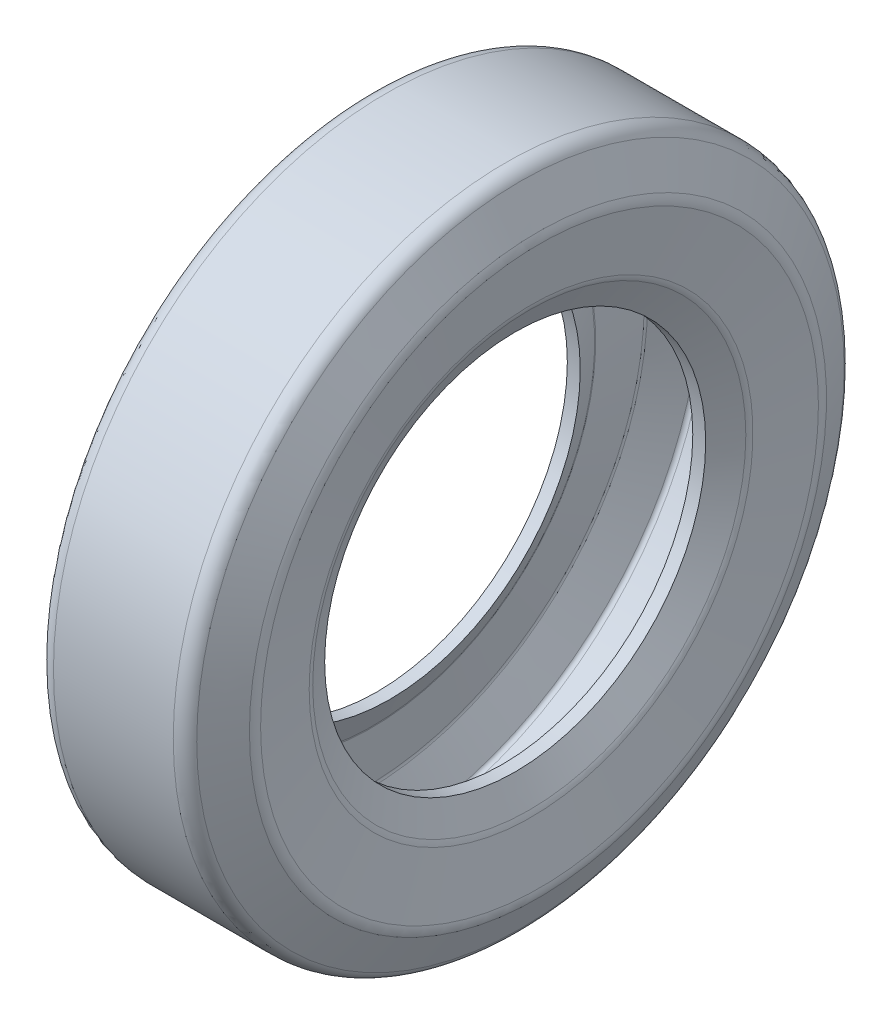
ISO-10303-21;
HEADER;
FILE_DESCRIPTION(('STEP AP214'),'2;1');
FILE_NAME('part.step','',(''),(''),'','','');
FILE_SCHEMA(('AUTOMOTIVE_DESIGN { 1 0 10303 214 1 1 1 1 }'));
ENDSEC;
DATA;
#1=APPLICATION_CONTEXT('core data for automotive mechanical design processes');
#2=APPLICATION_PROTOCOL_DEFINITION('international standard','automotive_design',2000,#1);
#3=PRODUCT_CONTEXT('',#1,'mechanical');
#4=PRODUCT('Part','Part','',(#3));
#5=PRODUCT_RELATED_PRODUCT_CATEGORY('part','',(#4));
#6=PRODUCT_DEFINITION_FORMATION('','',#4);
#7=PRODUCT_DEFINITION_CONTEXT('part definition',#1,'design');
#8=PRODUCT_DEFINITION('design','',#6,#7);
#9=PRODUCT_DEFINITION_SHAPE('','',#8);
#10=(LENGTH_UNIT() NAMED_UNIT(*) SI_UNIT(.MILLI.,.METRE.));
#11=(NAMED_UNIT(*) PLANE_ANGLE_UNIT() SI_UNIT($,.RADIAN.));
#12=(NAMED_UNIT(*) SI_UNIT($,.STERADIAN.) SOLID_ANGLE_UNIT());
#13=UNCERTAINTY_MEASURE_WITH_UNIT(LENGTH_MEASURE(1.E-05),#10,'distance_accuracy_value','');
#14=(GEOMETRIC_REPRESENTATION_CONTEXT(3) GLOBAL_UNCERTAINTY_ASSIGNED_CONTEXT((#13)) GLOBAL_UNIT_ASSIGNED_CONTEXT((#10,
#11,#12)) REPRESENTATION_CONTEXT('',''));
#15=CARTESIAN_POINT('',(0.,0.,0.));
#16=DIRECTION('',(0.,0.,1.));
#17=DIRECTION('',(1.,0.,0.));
#18=AXIS2_PLACEMENT_3D('',#15,#16,#17);
#19=CARTESIAN_POINT('',(-234.496124031008,0.,0.));
#20=DIRECTION('',(-1.,0.,0.));
#21=DIRECTION('',(0.,0.,1.));
#22=AXIS2_PLACEMENT_3D('',#19,#20,#21);
#23=CYLINDRICAL_SURFACE('',#22,117.412834164463);
#24=CARTESIAN_POINT('',(-42.6353370457909,0.,0.));
#25=DIRECTION('',(-1.,0.,0.));
#26=DIRECTION('',(0.,0.,1.));
#27=AXIS2_PLACEMENT_3D('',#24,#25,#26);
#28=CIRCLE('',#27,117.412834164463);
#29=CARTESIAN_POINT('',(-42.6353370457909,0.,117.412834164463));
#30=VERTEX_POINT('',#29);
#31=EDGE_CURVE('E44',#30,#30,#28,.T.);
#32=ORIENTED_EDGE('',*,*,#31,.T.);
#33=EDGE_LOOP('',(#32));
#34=FACE_BOUND('',#33,.T.);
#35=CARTESIAN_POINT('',(-34.6749867932723,0.,0.));
#36=DIRECTION('',(-1.,0.,0.));
#37=DIRECTION('',(0.,0.,1.));
#38=AXIS2_PLACEMENT_3D('',#35,#36,#37);
#39=CIRCLE('',#38,117.412834164463);
#40=CARTESIAN_POINT('',(-34.6749867932723,0.,117.412834164463));
#41=VERTEX_POINT('',#40);
#42=EDGE_CURVE('E84',#41,#41,#39,.T.);
#43=ORIENTED_EDGE('',*,*,#42,.F.);
#44=EDGE_LOOP('',(#43));
#45=FACE_BOUND('',#44,.T.);
#46=ADVANCED_FACE('F33',(#34,#45),#23,.F.);
#47=CARTESIAN_POINT('',(42.5253680064834,0.,0.));
#48=DIRECTION('',(-1.,0.,0.));
#49=DIRECTION('',(0.,0.,1.));
#50=AXIS2_PLACEMENT_3D('',#47,#48,#49);
#51=TOROIDAL_SURFACE('',#50,138.211060890307,9.99999999999999);
#52=CARTESIAN_POINT('',(52.4171984301819,0.,0.));
#53=DIRECTION('',(-1.,0.,0.));
#54=DIRECTION('',(0.,0.,1.));
#55=AXIS2_PLACEMENT_3D('',#52,#53,#54);
#56=CIRCLE('',#55,136.744196592291);
#57=CARTESIAN_POINT('',(52.4171984301819,0.,136.744196592291));
#58=VERTEX_POINT('',#57);
#59=EDGE_CURVE('E80',#58,#58,#56,.T.);
#60=ORIENTED_EDGE('',*,*,#59,.F.);
#61=EDGE_LOOP('',(#60));
#62=FACE_BOUND('',#61,.T.);
#63=CARTESIAN_POINT('',(51.3189509242517,0.,0.));
#64=DIRECTION('',(-1.,0.,0.));
#65=DIRECTION('',(0.,0.,1.));
#66=AXIS2_PLACEMENT_3D('',#63,#64,#65);
#67=CIRCLE('',#66,133.4494540745);
#68=CARTESIAN_POINT('',(51.3189509242517,0.,133.4494540745));
#69=VERTEX_POINT('',#68);
#70=EDGE_CURVE('E10',#69,#69,#67,.T.);
#71=ORIENTED_EDGE('',*,*,#70,.T.);
#72=EDGE_LOOP('',(#71));
#73=FACE_BOUND('',#72,.T.);
#74=ADVANCED_FACE('F35',(#62,#73),#51,.T.);
#75=CARTESIAN_POINT('',(42.6353370457909,0.,0.));
#76=DIRECTION('',(1.,0.,0.));
#77=DIRECTION('',(0.,0.,-1.));
#78=AXIS2_PLACEMENT_3D('',#75,#76,#77);
#79=CONICAL_SURFACE('',#78,117.412834164463,1.07451284719882);
#80=ORIENTED_EDGE('',*,*,#70,.F.);
#81=EDGE_LOOP('',(#80));
#82=FACE_BOUND('',#81,.T.);
#83=CARTESIAN_POINT('',(42.6353370457909,0.,0.));
#84=DIRECTION('',(-1.,0.,0.));
#85=DIRECTION('',(0.,0.,1.));
#86=AXIS2_PLACEMENT_3D('',#83,#84,#85);
#87=CIRCLE('',#86,117.412834164463);
#88=CARTESIAN_POINT('',(42.6353370457909,0.,117.412834164463));
#89=VERTEX_POINT('',#88);
#90=EDGE_CURVE('E40',#89,#89,#87,.T.);
#91=ORIENTED_EDGE('',*,*,#90,.T.);
#92=EDGE_LOOP('',(#91));
#93=FACE_BOUND('',#92,.T.);
#94=ADVANCED_FACE('F148',(#82,#93),#79,.F.);
#95=CARTESIAN_POINT('',(34.6749867932723,0.,0.));
#96=DIRECTION('',(1.,0.,0.));
#97=DIRECTION('',(0.,0.,-1.));
#98=AXIS2_PLACEMENT_3D('',#95,#96,#97);
#99=CIRCLE('',#98,117.412834164463);
#100=CARTESIAN_POINT('',(34.6749867932723,0.,-117.412834164463));
#101=VERTEX_POINT('',#100);
#102=EDGE_CURVE('E87',#101,#101,#99,.F.);
#103=ORIENTED_EDGE('',*,*,#102,.T.);
#104=EDGE_LOOP('',(#103));
#105=FACE_BOUND('',#104,.T.);
#106=ORIENTED_EDGE('',*,*,#90,.F.);
#107=EDGE_LOOP('',(#106));
#108=FACE_BOUND('',#107,.T.);
#109=ADVANCED_FACE('F144',(#105,#108),#23,.F.);
#110=CARTESIAN_POINT('',(-51.3189509242517,0.,0.));
#111=DIRECTION('',(-1.,0.,0.));
#112=DIRECTION('',(0.,0.,1.));
#113=AXIS2_PLACEMENT_3D('',#110,#111,#112);
#114=CONICAL_SURFACE('',#113,133.4494540745,1.07451284719882);
#115=ORIENTED_EDGE('',*,*,#31,.F.);
#116=EDGE_LOOP('',(#115));
#117=FACE_BOUND('',#116,.T.);
#118=CARTESIAN_POINT('',(-51.3189509242517,0.,0.));
#119=DIRECTION('',(-1.,0.,0.));
#120=DIRECTION('',(0.,0.,1.));
#121=AXIS2_PLACEMENT_3D('',#118,#119,#120);
#122=CIRCLE('',#121,133.4494540745);
#123=CARTESIAN_POINT('',(-51.3189509242517,0.,133.4494540745));
#124=VERTEX_POINT('',#123);
#125=EDGE_CURVE('E48',#124,#124,#122,.T.);
#126=ORIENTED_EDGE('',*,*,#125,.T.);
#127=EDGE_LOOP('',(#126));
#128=FACE_BOUND('',#127,.T.);
#129=ADVANCED_FACE('F153',(#117,#128),#114,.F.);
#130=CARTESIAN_POINT('',(-42.5253680064834,0.,0.));
#131=DIRECTION('',(-1.,0.,0.));
#132=DIRECTION('',(0.,0.,1.));
#133=AXIS2_PLACEMENT_3D('',#130,#131,#132);
#134=TOROIDAL_SURFACE('',#133,138.211060890307,9.99999999999999);
#135=ORIENTED_EDGE('',*,*,#125,.F.);
#136=EDGE_LOOP('',(#135));
#137=FACE_BOUND('',#136,.T.);
#138=CARTESIAN_POINT('',(-52.4171984301819,0.,0.));
#139=DIRECTION('',(-1.,0.,0.));
#140=DIRECTION('',(0.,0.,1.));
#141=AXIS2_PLACEMENT_3D('',#138,#139,#140);
#142=CIRCLE('',#141,136.744196592291);
#143=CARTESIAN_POINT('',(-52.4171984301819,0.,136.744196592291));
#144=VERTEX_POINT('',#143);
#145=EDGE_CURVE('E53',#144,#144,#142,.T.);
#146=ORIENTED_EDGE('',*,*,#145,.T.);
#147=EDGE_LOOP('',(#146));
#148=FACE_BOUND('',#147,.T.);
#149=ADVANCED_FACE('F159',(#137,#148),#134,.T.);
#150=CARTESIAN_POINT('',(-57.6276694071352,0.,0.));
#151=DIRECTION('',(-1.,0.,0.));
#152=DIRECTION('',(0.,0.,1.));
#153=AXIS2_PLACEMENT_3D('',#150,#151,#152);
#154=CONICAL_SURFACE('',#153,171.881117847612,1.42357869759769);
#155=ORIENTED_EDGE('',*,*,#145,.F.);
#156=EDGE_LOOP('',(#155));
#157=FACE_BOUND('',#156,.T.);
#158=CARTESIAN_POINT('',(-57.6276694071352,0.,0.));
#159=DIRECTION('',(-1.,0.,0.));
#160=DIRECTION('',(0.,0.,1.));
#161=AXIS2_PLACEMENT_3D('',#158,#159,#160);
#162=CIRCLE('',#161,171.881117847612);
#163=CARTESIAN_POINT('',(-57.6276694071352,0.,171.881117847612));
#164=VERTEX_POINT('',#163);
#165=EDGE_CURVE('E56',#164,#164,#162,.T.);
#166=ORIENTED_EDGE('',*,*,#165,.T.);
#167=EDGE_LOOP('',(#166));
#168=FACE_BOUND('',#167,.T.);
#169=ADVANCED_FACE('F357',(#157,#168),#154,.F.);
#170=CARTESIAN_POINT('',(-47.7358389834368,0.,0.));
#171=DIRECTION('',(-1.,0.,0.));
#172=DIRECTION('',(0.,0.,1.));
#173=AXIS2_PLACEMENT_3D('',#170,#171,#172);
#174=TOROIDAL_SURFACE('',#173,173.347982145627,9.99999999999999);
#175=ORIENTED_EDGE('',*,*,#165,.F.);
#176=EDGE_LOOP('',(#175));
#177=FACE_BOUND('',#176,.T.);
#178=CARTESIAN_POINT('',(-56.6801108934359,0.,0.));
#179=DIRECTION('',(-1.,0.,0.));
#180=DIRECTION('',(0.,0.,1.));
#181=AXIS2_PLACEMENT_3D('',#178,#179,#180);
#182=CIRCLE('',#181,177.820118100627);
#183=CARTESIAN_POINT('',(-56.6801108934359,0.,177.820118100627));
#184=VERTEX_POINT('',#183);
#185=EDGE_CURVE('E59',#184,#184,#182,.T.);
#186=ORIENTED_EDGE('',*,*,#185,.T.);
#187=EDGE_LOOP('',(#186));
#188=FACE_BOUND('',#187,.T.);
#189=ADVANCED_FACE('F347',(#177,#188),#174,.T.);
#190=CARTESIAN_POINT('',(-45.8541019662497,0.,0.));
#191=DIRECTION('',(1.,0.,0.));
#192=DIRECTION('',(0.,0.,-1.));
#193=AXIS2_PLACEMENT_3D('',#190,#191,#192);
#194=CONICAL_SURFACE('',#193,199.472135955,1.10714871779409);
#195=ORIENTED_EDGE('',*,*,#185,.F.);
#196=EDGE_LOOP('',(#195));
#197=FACE_BOUND('',#196,.T.);
#198=CARTESIAN_POINT('',(-45.8541019662497,0.,0.));
#199=DIRECTION('',(-1.,0.,0.));
#200=DIRECTION('',(0.,0.,1.));
#201=AXIS2_PLACEMENT_3D('',#198,#199,#200);
#202=CIRCLE('',#201,199.472135955);
#203=CARTESIAN_POINT('',(-45.8541019662497,0.,199.472135955));
#204=VERTEX_POINT('',#203);
#205=EDGE_CURVE('E62',#204,#204,#202,.T.);
#206=ORIENTED_EDGE('',*,*,#205,.T.);
#207=EDGE_LOOP('',(#206));
#208=FACE_BOUND('',#207,.T.);
#209=ADVANCED_FACE('F338',(#197,#208),#194,.T.);
#210=CARTESIAN_POINT('',(-36.9098300562505,0.,0.));
#211=DIRECTION('',(-1.,0.,0.));
#212=DIRECTION('',(0.,0.,1.));
#213=AXIS2_PLACEMENT_3D('',#210,#211,#212);
#214=TOROIDAL_SURFACE('',#213,195.,9.99999999999999);
#215=ORIENTED_EDGE('',*,*,#205,.F.);
#216=EDGE_LOOP('',(#215));
#217=FACE_BOUND('',#216,.T.);
#218=CARTESIAN_POINT('',(-36.9098300562505,0.,0.));
#219=DIRECTION('',(-1.,0.,0.));
#220=DIRECTION('',(0.,0.,1.));
#221=AXIS2_PLACEMENT_3D('',#218,#219,#220);
#222=CIRCLE('',#221,205.);
#223=CARTESIAN_POINT('',(-36.9098300562505,0.,205.));
#224=VERTEX_POINT('',#223);
#225=EDGE_CURVE('E65',#224,#224,#222,.T.);
#226=ORIENTED_EDGE('',*,*,#225,.T.);
#227=EDGE_LOOP('',(#226));
#228=FACE_BOUND('',#227,.T.);
#229=ADVANCED_FACE('F328',(#217,#228),#214,.T.);
#230=CARTESIAN_POINT('',(-234.496124031008,0.,0.));
#231=DIRECTION('',(-1.,0.,0.));
#232=DIRECTION('',(0.,0.,1.));
#233=AXIS2_PLACEMENT_3D('',#230,#231,#232);
#234=CYLINDRICAL_SURFACE('',#233,205.);
#235=ORIENTED_EDGE('',*,*,#225,.F.);
#236=EDGE_LOOP('',(#235));
#237=FACE_BOUND('',#236,.T.);
#238=CARTESIAN_POINT('',(36.9098300562505,0.,0.));
#239=DIRECTION('',(-1.,0.,0.));
#240=DIRECTION('',(0.,0.,1.));
#241=AXIS2_PLACEMENT_3D('',#238,#239,#240);
#242=CIRCLE('',#241,205.);
#243=CARTESIAN_POINT('',(36.9098300562505,0.,205.));
#244=VERTEX_POINT('',#243);
#245=EDGE_CURVE('E68',#244,#244,#242,.T.);
#246=ORIENTED_EDGE('',*,*,#245,.T.);
#247=EDGE_LOOP('',(#246));
#248=FACE_BOUND('',#247,.T.);
#249=ADVANCED_FACE('F319',(#237,#248),#234,.T.);
#250=CARTESIAN_POINT('',(36.9098300562505,0.,0.));
#251=DIRECTION('',(-1.,0.,0.));
#252=DIRECTION('',(0.,0.,1.));
#253=AXIS2_PLACEMENT_3D('',#250,#251,#252);
#254=TOROIDAL_SURFACE('',#253,195.,9.99999999999999);
#255=ORIENTED_EDGE('',*,*,#245,.F.);
#256=EDGE_LOOP('',(#255));
#257=FACE_BOUND('',#256,.T.);
#258=CARTESIAN_POINT('',(45.8541019662497,0.,0.));
#259=DIRECTION('',(-1.,0.,0.));
#260=DIRECTION('',(0.,0.,1.));
#261=AXIS2_PLACEMENT_3D('',#258,#259,#260);
#262=CIRCLE('',#261,199.472135955);
#263=CARTESIAN_POINT('',(45.8541019662497,0.,199.472135955));
#264=VERTEX_POINT('',#263);
#265=EDGE_CURVE('E71',#264,#264,#262,.T.);
#266=ORIENTED_EDGE('',*,*,#265,.T.);
#267=EDGE_LOOP('',(#266));
#268=FACE_BOUND('',#267,.T.);
#269=ADVANCED_FACE('F309',(#257,#268),#254,.T.);
#270=CARTESIAN_POINT('',(56.6801108934359,0.,0.));
#271=DIRECTION('',(-1.,0.,0.));
#272=DIRECTION('',(0.,0.,1.));
#273=AXIS2_PLACEMENT_3D('',#270,#271,#272);
#274=CONICAL_SURFACE('',#273,177.820118100627,1.10714871779409);
#275=ORIENTED_EDGE('',*,*,#265,.F.);
#276=EDGE_LOOP('',(#275));
#277=FACE_BOUND('',#276,.T.);
#278=CARTESIAN_POINT('',(56.6801108934359,0.,0.));
#279=DIRECTION('',(-1.,0.,0.));
#280=DIRECTION('',(0.,0.,1.));
#281=AXIS2_PLACEMENT_3D('',#278,#279,#280);
#282=CIRCLE('',#281,177.820118100627);
#283=CARTESIAN_POINT('',(56.6801108934359,0.,177.820118100627));
#284=VERTEX_POINT('',#283);
#285=EDGE_CURVE('E74',#284,#284,#282,.T.);
#286=ORIENTED_EDGE('',*,*,#285,.T.);
#287=EDGE_LOOP('',(#286));
#288=FACE_BOUND('',#287,.T.);
#289=ADVANCED_FACE('F300',(#277,#288),#274,.T.);
#290=CARTESIAN_POINT('',(47.7358389834368,0.,0.));
#291=DIRECTION('',(-1.,0.,0.));
#292=DIRECTION('',(0.,0.,1.));
#293=AXIS2_PLACEMENT_3D('',#290,#291,#292);
#294=TOROIDAL_SURFACE('',#293,173.347982145627,9.99999999999999);
#295=ORIENTED_EDGE('',*,*,#285,.F.);
#296=EDGE_LOOP('',(#295));
#297=FACE_BOUND('',#296,.T.);
#298=CARTESIAN_POINT('',(57.6276694071353,0.,0.));
#299=DIRECTION('',(-1.,0.,0.));
#300=DIRECTION('',(0.,0.,1.));
#301=AXIS2_PLACEMENT_3D('',#298,#299,#300);
#302=CIRCLE('',#301,171.881117847612);
#303=CARTESIAN_POINT('',(57.6276694071353,0.,171.881117847612));
#304=VERTEX_POINT('',#303);
#305=EDGE_CURVE('E77',#304,#304,#302,.T.);
#306=ORIENTED_EDGE('',*,*,#305,.T.);
#307=EDGE_LOOP('',(#306));
#308=FACE_BOUND('',#307,.T.);
#309=ADVANCED_FACE('F291',(#297,#308),#294,.T.);
#310=CARTESIAN_POINT('',(52.4171984301819,0.,0.));
#311=DIRECTION('',(1.,0.,0.));
#312=DIRECTION('',(0.,0.,-1.));
#313=AXIS2_PLACEMENT_3D('',#310,#311,#312);
#314=CONICAL_SURFACE('',#313,136.744196592291,1.42357869759769);
#315=ORIENTED_EDGE('',*,*,#305,.F.);
#316=EDGE_LOOP('',(#315));
#317=FACE_BOUND('',#316,.T.);
#318=ORIENTED_EDGE('',*,*,#59,.T.);
#319=EDGE_LOOP('',(#318));
#320=FACE_BOUND('',#319,.T.);
#321=ADVANCED_FACE('F177',(#317,#320),#314,.F.);
#322=CARTESIAN_POINT('',(42.5253680064834,0.,0.));
#323=DIRECTION('',(-1.,0.,0.));
#324=DIRECTION('',(0.,0.,1.));
#325=AXIS2_PLACEMENT_3D('',#322,#323,#324);
#326=TOROIDAL_SURFACE('',#325,138.211060890307,2.99999999999999);
#327=CARTESIAN_POINT('',(45.492917133593,0.,0.));
#328=DIRECTION('',(1.,0.,0.));
#329=DIRECTION('',(0.,0.,-1.));
#330=AXIS2_PLACEMENT_3D('',#327,#328,#329);
#331=CIRCLE('',#330,137.771001600902);
#332=CARTESIAN_POINT('',(45.492917133593,0.,-137.771001600902));
#333=VERTEX_POINT('',#332);
#334=EDGE_CURVE('E120',#333,#333,#331,.F.);
#335=ORIENTED_EDGE('',*,*,#334,.T.);
#336=EDGE_LOOP('',(#335));
#337=FACE_BOUND('',#336,.T.);
#338=CARTESIAN_POINT('',(45.1634428818139,0.,0.));
#339=DIRECTION('',(-1.,0.,0.));
#340=DIRECTION('',(0.,0.,1.));
#341=AXIS2_PLACEMENT_3D('',#338,#339,#340);
#342=CIRCLE('',#341,136.782578845565);
#343=CARTESIAN_POINT('',(45.1634428818139,0.,136.782578845565));
#344=VERTEX_POINT('',#343);
#345=EDGE_CURVE('E83',#344,#344,#342,.T.);
#346=ORIENTED_EDGE('',*,*,#345,.F.);
#347=EDGE_LOOP('',(#346));
#348=FACE_BOUND('',#347,.T.);
#349=ADVANCED_FACE('F126',(#337,#348),#326,.F.);
#350=CARTESIAN_POINT('',(36.4798290033531,0.,0.));
#351=DIRECTION('',(1.,0.,0.));
#352=DIRECTION('',(0.,0.,-1.));
#353=AXIS2_PLACEMENT_3D('',#350,#351,#352);
#354=CONICAL_SURFACE('',#353,120.745958935528,1.07451284719882);
#355=ORIENTED_EDGE('',*,*,#345,.T.);
#356=EDGE_LOOP('',(#355));
#357=FACE_BOUND('',#356,.T.);
#358=ORIENTED_EDGE('',*,*,#102,.F.);
#359=EDGE_LOOP('',(#358));
#360=FACE_BOUND('',#359,.T.);
#361=ADVANCED_FACE('F165',(#357,#360),#354,.T.);
#362=CARTESIAN_POINT('',(-45.1634428818139,0.,0.));
#363=DIRECTION('',(-1.,0.,0.));
#364=DIRECTION('',(0.,0.,1.));
#365=AXIS2_PLACEMENT_3D('',#362,#363,#364);
#366=CONICAL_SURFACE('',#365,136.782578845565,1.07451284719882);
#367=ORIENTED_EDGE('',*,*,#42,.T.);
#368=EDGE_LOOP('',(#367));
#369=FACE_BOUND('',#368,.T.);
#370=CARTESIAN_POINT('',(-45.1634428818139,0.,0.));
#371=DIRECTION('',(-1.,0.,0.));
#372=DIRECTION('',(0.,0.,1.));
#373=AXIS2_PLACEMENT_3D('',#370,#371,#372);
#374=CIRCLE('',#373,136.782578845565);
#375=CARTESIAN_POINT('',(-45.1634428818139,0.,136.782578845565));
#376=VERTEX_POINT('',#375);
#377=EDGE_CURVE('E88',#376,#376,#374,.T.);
#378=ORIENTED_EDGE('',*,*,#377,.F.);
#379=EDGE_LOOP('',(#378));
#380=FACE_BOUND('',#379,.T.);
#381=ADVANCED_FACE('F167',(#369,#380),#366,.T.);
#382=CARTESIAN_POINT('',(-42.5253680064834,0.,0.));
#383=DIRECTION('',(-1.,0.,0.));
#384=DIRECTION('',(0.,0.,1.));
#385=AXIS2_PLACEMENT_3D('',#382,#383,#384);
#386=TOROIDAL_SURFACE('',#385,138.211060890307,2.99999999999999);
#387=ORIENTED_EDGE('',*,*,#377,.T.);
#388=EDGE_LOOP('',(#387));
#389=FACE_BOUND('',#388,.T.);
#390=CARTESIAN_POINT('',(-45.4929171335929,0.,0.));
#391=DIRECTION('',(-1.,0.,0.));
#392=DIRECTION('',(0.,0.,1.));
#393=AXIS2_PLACEMENT_3D('',#390,#391,#392);
#394=CIRCLE('',#393,137.771001600902);
#395=CARTESIAN_POINT('',(-45.4929171335929,0.,137.771001600902));
#396=VERTEX_POINT('',#395);
#397=EDGE_CURVE('E93',#396,#396,#394,.T.);
#398=ORIENTED_EDGE('',*,*,#397,.F.);
#399=EDGE_LOOP('',(#398));
#400=FACE_BOUND('',#399,.T.);
#401=ADVANCED_FACE('F174',(#389,#400),#386,.F.);
#402=CARTESIAN_POINT('',(-50.7033881105463,0.,0.));
#403=DIRECTION('',(-1.,0.,0.));
#404=DIRECTION('',(0.,0.,1.));
#405=AXIS2_PLACEMENT_3D('',#402,#403,#404);
#406=CONICAL_SURFACE('',#405,172.907922856223,1.42357869759769);
#407=ORIENTED_EDGE('',*,*,#397,.T.);
#408=EDGE_LOOP('',(#407));
#409=FACE_BOUND('',#408,.T.);
#410=CARTESIAN_POINT('',(-50.7033881105463,0.,0.));
#411=DIRECTION('',(-1.,0.,0.));
#412=DIRECTION('',(0.,0.,1.));
#413=AXIS2_PLACEMENT_3D('',#410,#411,#412);
#414=CIRCLE('',#413,172.907922856223);
#415=CARTESIAN_POINT('',(-50.7033881105463,0.,172.907922856223));
#416=VERTEX_POINT('',#415);
#417=EDGE_CURVE('E96',#416,#416,#414,.T.);
#418=ORIENTED_EDGE('',*,*,#417,.F.);
#419=EDGE_LOOP('',(#418));
#420=FACE_BOUND('',#419,.T.);
#421=ADVANCED_FACE('F182',(#409,#420),#406,.T.);
#422=CARTESIAN_POINT('',(-47.7358389834368,0.,0.));
#423=DIRECTION('',(-1.,0.,0.));
#424=DIRECTION('',(0.,0.,1.));
#425=AXIS2_PLACEMENT_3D('',#422,#423,#424);
#426=TOROIDAL_SURFACE('',#425,173.347982145627,3.);
#427=ORIENTED_EDGE('',*,*,#417,.T.);
#428=EDGE_LOOP('',(#427));
#429=FACE_BOUND('',#428,.T.);
#430=CARTESIAN_POINT('',(-50.4191205564365,0.,0.));
#431=DIRECTION('',(-1.,0.,0.));
#432=DIRECTION('',(0.,0.,1.));
#433=AXIS2_PLACEMENT_3D('',#430,#431,#432);
#434=CIRCLE('',#433,174.689622932127);
#435=CARTESIAN_POINT('',(-50.4191205564365,0.,174.689622932127));
#436=VERTEX_POINT('',#435);
#437=EDGE_CURVE('E99',#436,#436,#434,.T.);
#438=ORIENTED_EDGE('',*,*,#437,.F.);
#439=EDGE_LOOP('',(#438));
#440=FACE_BOUND('',#439,.T.);
#441=ADVANCED_FACE('F186',(#429,#440),#426,.F.);
#442=CARTESIAN_POINT('',(-39.5931116292503,0.,0.));
#443=DIRECTION('',(1.,0.,0.));
#444=DIRECTION('',(0.,0.,-1.));
#445=AXIS2_PLACEMENT_3D('',#442,#443,#444);
#446=CONICAL_SURFACE('',#445,196.3416407865,1.10714871779409);
#447=ORIENTED_EDGE('',*,*,#437,.T.);
#448=EDGE_LOOP('',(#447));
#449=FACE_BOUND('',#448,.T.);
#450=CARTESIAN_POINT('',(-39.5931116292503,0.,0.));
#451=DIRECTION('',(1.,0.,0.));
#452=DIRECTION('',(0.,0.,-1.));
#453=AXIS2_PLACEMENT_3D('',#450,#451,#452);
#454=CIRCLE('',#453,196.3416407865);
#455=CARTESIAN_POINT('',(-39.5931116292503,0.,-196.3416407865));
#456=VERTEX_POINT('',#455);
#457=EDGE_CURVE('E102',#456,#456,#454,.F.);
#458=ORIENTED_EDGE('',*,*,#457,.F.);
#459=EDGE_LOOP('',(#458));
#460=FACE_BOUND('',#459,.T.);
#461=ADVANCED_FACE('F190',(#449,#460),#446,.F.);
#462=CARTESIAN_POINT('',(-36.9098300562505,0.,0.));
#463=DIRECTION('',(-1.,0.,0.));
#464=DIRECTION('',(0.,0.,1.));
#465=AXIS2_PLACEMENT_3D('',#462,#463,#464);
#466=TOROIDAL_SURFACE('',#465,195.,3.);
#467=ORIENTED_EDGE('',*,*,#457,.T.);
#468=EDGE_LOOP('',(#467));
#469=FACE_BOUND('',#468,.T.);
#470=CARTESIAN_POINT('',(-36.9098300562505,0.,0.));
#471=DIRECTION('',(-1.,0.,0.));
#472=DIRECTION('',(0.,0.,1.));
#473=AXIS2_PLACEMENT_3D('',#470,#471,#472);
#474=CIRCLE('',#473,198.);
#475=CARTESIAN_POINT('',(-36.9098300562505,0.,198.));
#476=VERTEX_POINT('',#475);
#477=EDGE_CURVE('E105',#476,#476,#474,.T.);
#478=ORIENTED_EDGE('',*,*,#477,.F.);
#479=EDGE_LOOP('',(#478));
#480=FACE_BOUND('',#479,.T.);
#481=ADVANCED_FACE('F194',(#469,#480),#466,.F.);
#482=CARTESIAN_POINT('',(-234.496124031008,0.,0.));
#483=DIRECTION('',(-1.,0.,0.));
#484=DIRECTION('',(0.,0.,1.));
#485=AXIS2_PLACEMENT_3D('',#482,#483,#484);
#486=CYLINDRICAL_SURFACE('',#485,198.);
#487=ORIENTED_EDGE('',*,*,#477,.T.);
#488=EDGE_LOOP('',(#487));
#489=FACE_BOUND('',#488,.T.);
#490=CARTESIAN_POINT('',(36.9098300562505,0.,0.));
#491=DIRECTION('',(-1.,0.,0.));
#492=DIRECTION('',(0.,0.,1.));
#493=AXIS2_PLACEMENT_3D('',#490,#491,#492);
#494=CIRCLE('',#493,198.);
#495=CARTESIAN_POINT('',(36.9098300562505,0.,198.));
#496=VERTEX_POINT('',#495);
#497=EDGE_CURVE('E108',#496,#496,#494,.T.);
#498=ORIENTED_EDGE('',*,*,#497,.F.);
#499=EDGE_LOOP('',(#498));
#500=FACE_BOUND('',#499,.T.);
#501=ADVANCED_FACE('F198',(#489,#500),#486,.F.);
#502=CARTESIAN_POINT('',(36.9098300562505,0.,0.));
#503=DIRECTION('',(-1.,0.,0.));
#504=DIRECTION('',(0.,0.,1.));
#505=AXIS2_PLACEMENT_3D('',#502,#503,#504);
#506=TOROIDAL_SURFACE('',#505,195.,3.);
#507=ORIENTED_EDGE('',*,*,#497,.T.);
#508=EDGE_LOOP('',(#507));
#509=FACE_BOUND('',#508,.T.);
#510=CARTESIAN_POINT('',(39.5931116292503,0.,0.));
#511=DIRECTION('',(-1.,0.,0.));
#512=DIRECTION('',(0.,0.,1.));
#513=AXIS2_PLACEMENT_3D('',#510,#511,#512);
#514=CIRCLE('',#513,196.3416407865);
#515=CARTESIAN_POINT('',(39.5931116292503,0.,196.3416407865));
#516=VERTEX_POINT('',#515);
#517=EDGE_CURVE('E111',#516,#516,#514,.T.);
#518=ORIENTED_EDGE('',*,*,#517,.F.);
#519=EDGE_LOOP('',(#518));
#520=FACE_BOUND('',#519,.T.);
#521=ADVANCED_FACE('F202',(#509,#520),#506,.F.);
#522=CARTESIAN_POINT('',(50.4191205564365,0.,0.));
#523=DIRECTION('',(-1.,0.,0.));
#524=DIRECTION('',(0.,0.,1.));
#525=AXIS2_PLACEMENT_3D('',#522,#523,#524);
#526=CONICAL_SURFACE('',#525,174.689622932127,1.10714871779409);
#527=ORIENTED_EDGE('',*,*,#517,.T.);
#528=EDGE_LOOP('',(#527));
#529=FACE_BOUND('',#528,.T.);
#530=CARTESIAN_POINT('',(50.4191205564365,0.,0.));
#531=DIRECTION('',(-1.,0.,0.));
#532=DIRECTION('',(0.,0.,1.));
#533=AXIS2_PLACEMENT_3D('',#530,#531,#532);
#534=CIRCLE('',#533,174.689622932127);
#535=CARTESIAN_POINT('',(50.4191205564365,0.,174.689622932127));
#536=VERTEX_POINT('',#535);
#537=EDGE_CURVE('E114',#536,#536,#534,.T.);
#538=ORIENTED_EDGE('',*,*,#537,.F.);
#539=EDGE_LOOP('',(#538));
#540=FACE_BOUND('',#539,.T.);
#541=ADVANCED_FACE('F137',(#529,#540),#526,.F.);
#542=CARTESIAN_POINT('',(47.7358389834368,0.,0.));
#543=DIRECTION('',(-1.,0.,0.));
#544=DIRECTION('',(0.,0.,1.));
#545=AXIS2_PLACEMENT_3D('',#542,#543,#544);
#546=TOROIDAL_SURFACE('',#545,173.347982145627,3.);
#547=ORIENTED_EDGE('',*,*,#537,.T.);
#548=EDGE_LOOP('',(#547));
#549=FACE_BOUND('',#548,.T.);
#550=CARTESIAN_POINT('',(50.7033881105463,0.,0.));
#551=DIRECTION('',(-1.,0.,0.));
#552=DIRECTION('',(0.,0.,1.));
#553=AXIS2_PLACEMENT_3D('',#550,#551,#552);
#554=CIRCLE('',#553,172.907922856223);
#555=CARTESIAN_POINT('',(50.7033881105463,0.,172.907922856223));
#556=VERTEX_POINT('',#555);
#557=EDGE_CURVE('E117',#556,#556,#554,.T.);
#558=ORIENTED_EDGE('',*,*,#557,.F.);
#559=EDGE_LOOP('',(#558));
#560=FACE_BOUND('',#559,.T.);
#561=ADVANCED_FACE('F131',(#549,#560),#546,.F.);
#562=CARTESIAN_POINT('',(45.492917133593,0.,0.));
#563=DIRECTION('',(1.,0.,0.));
#564=DIRECTION('',(0.,0.,-1.));
#565=AXIS2_PLACEMENT_3D('',#562,#563,#564);
#566=CONICAL_SURFACE('',#565,137.771001600902,1.42357869759769);
#567=ORIENTED_EDGE('',*,*,#557,.T.);
#568=EDGE_LOOP('',(#567));
#569=FACE_BOUND('',#568,.T.);
#570=ORIENTED_EDGE('',*,*,#334,.F.);
#571=EDGE_LOOP('',(#570));
#572=FACE_BOUND('',#571,.T.);
#573=ADVANCED_FACE('F129',(#569,#572),#566,.T.);
#574=CLOSED_SHELL('',(#46,#74,#94,#109,#129,#149,#169,#189,#209,#229,#249,#269,#289,#309,#321,
#349,#361,#381,#401,#421,#441,#461,#481,#501,#521,#541,#561,#573));
#575=MANIFOLD_SOLID_BREP('B2',#574);
#576=ADVANCED_BREP_SHAPE_REPRESENTATION('',(#18,#575),#14);
#577=SHAPE_DEFINITION_REPRESENTATION(#9,#576);
ENDSEC;
END-ISO-10303-21;
